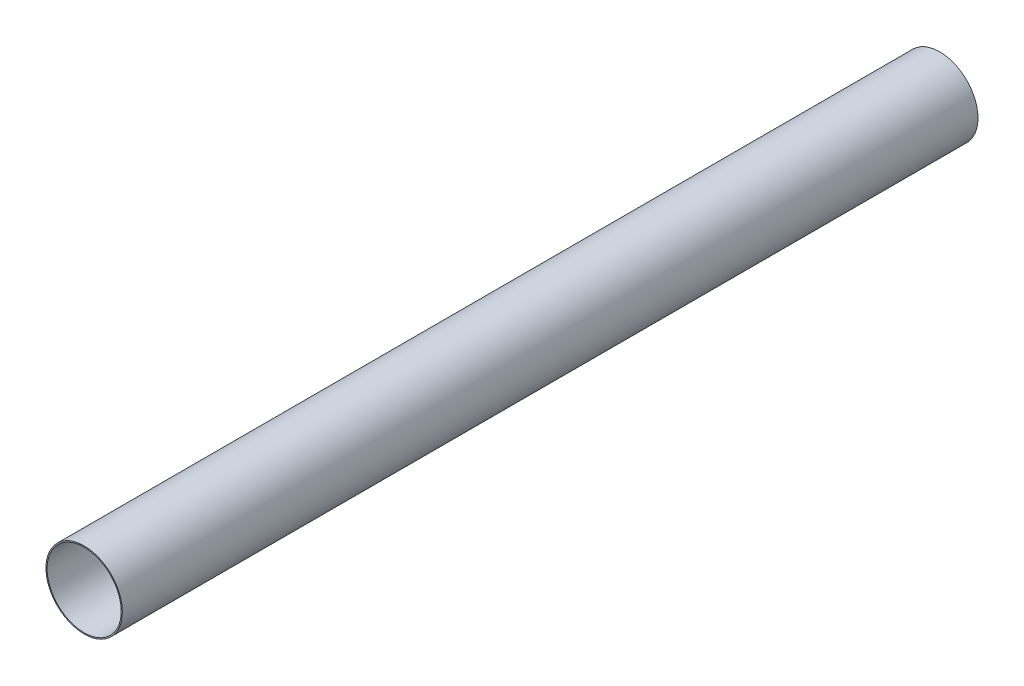
ISO-10303-21;
HEADER;
FILE_DESCRIPTION(('STEP AP214'),'2;1');
FILE_NAME('part.step','',(''),(''),'','','');
FILE_SCHEMA(('AUTOMOTIVE_DESIGN { 1 0 10303 214 1 1 1 1 }'));
ENDSEC;
DATA;
#1=APPLICATION_CONTEXT('core data for automotive mechanical design processes');
#2=APPLICATION_PROTOCOL_DEFINITION('international standard','automotive_design',2000,#1);
#3=PRODUCT_CONTEXT('',#1,'mechanical');
#4=PRODUCT('Part','Part','',(#3));
#5=PRODUCT_RELATED_PRODUCT_CATEGORY('part','',(#4));
#6=PRODUCT_DEFINITION_FORMATION('','',#4);
#7=PRODUCT_DEFINITION_CONTEXT('part definition',#1,'design');
#8=PRODUCT_DEFINITION('design','',#6,#7);
#9=PRODUCT_DEFINITION_SHAPE('','',#8);
#10=(LENGTH_UNIT() NAMED_UNIT(*) SI_UNIT(.MILLI.,.METRE.));
#11=(NAMED_UNIT(*) PLANE_ANGLE_UNIT() SI_UNIT($,.RADIAN.));
#12=(NAMED_UNIT(*) SI_UNIT($,.STERADIAN.) SOLID_ANGLE_UNIT());
#13=UNCERTAINTY_MEASURE_WITH_UNIT(LENGTH_MEASURE(1.E-05),#10,'distance_accuracy_value','');
#14=(GEOMETRIC_REPRESENTATION_CONTEXT(3) GLOBAL_UNCERTAINTY_ASSIGNED_CONTEXT((#13)) GLOBAL_UNIT_ASSIGNED_CONTEXT((#10,
#11,#12)) REPRESENTATION_CONTEXT('',''));
#15=CARTESIAN_POINT('',(0.,0.,0.));
#16=DIRECTION('',(0.,0.,1.));
#17=DIRECTION('',(1.,0.,0.));
#18=AXIS2_PLACEMENT_3D('',#15,#16,#17);
#19=CARTESIAN_POINT('',(0.,0.,1143.));
#20=DIRECTION('',(0.,0.,1.));
#21=DIRECTION('',(1.,0.,0.));
#22=AXIS2_PLACEMENT_3D('',#19,#20,#21);
#23=PLANE('',#22);
#24=CARTESIAN_POINT('',(0.,0.,1143.));
#25=DIRECTION('',(0.,0.,1.));
#26=DIRECTION('',(1.,0.,0.));
#27=AXIS2_PLACEMENT_3D('',#24,#25,#26);
#28=CIRCLE('',#27,51.054);
#29=CARTESIAN_POINT('',(51.054,0.,1143.));
#30=VERTEX_POINT('',#29);
#31=EDGE_CURVE('E10',#30,#30,#28,.T.);
#32=ORIENTED_EDGE('',*,*,#31,.T.);
#33=EDGE_LOOP('',(#32));
#34=FACE_BOUND('',#33,.T.);
#35=CARTESIAN_POINT('',(0.,0.,1143.));
#36=DIRECTION('',(0.,0.,1.));
#37=DIRECTION('',(1.,0.,0.));
#38=AXIS2_PLACEMENT_3D('',#35,#36,#37);
#39=CIRCLE('',#38,49.53);
#40=CARTESIAN_POINT('',(49.53,0.,1143.));
#41=VERTEX_POINT('',#40);
#42=EDGE_CURVE('E45',#41,#41,#39,.T.);
#43=ORIENTED_EDGE('',*,*,#42,.F.);
#44=EDGE_LOOP('',(#43));
#45=FACE_BOUND('',#44,.T.);
#46=ADVANCED_FACE('F34',(#34,#45),#23,.T.);
#47=CARTESIAN_POINT('',(0.,0.,0.));
#48=DIRECTION('',(0.,0.,1.));
#49=DIRECTION('',(1.,0.,0.));
#50=AXIS2_PLACEMENT_3D('',#47,#48,#49);
#51=PLANE('',#50);
#52=CARTESIAN_POINT('',(0.,0.,0.));
#53=DIRECTION('',(0.,0.,1.));
#54=DIRECTION('',(1.,0.,0.));
#55=AXIS2_PLACEMENT_3D('',#52,#53,#54);
#56=CIRCLE('',#55,51.054);
#57=CARTESIAN_POINT('',(51.054,0.,0.));
#58=VERTEX_POINT('',#57);
#59=EDGE_CURVE('E38',#58,#58,#56,.T.);
#60=ORIENTED_EDGE('',*,*,#59,.F.);
#61=EDGE_LOOP('',(#60));
#62=FACE_BOUND('',#61,.T.);
#63=CARTESIAN_POINT('',(0.,0.,0.));
#64=DIRECTION('',(0.,0.,1.));
#65=DIRECTION('',(1.,0.,0.));
#66=AXIS2_PLACEMENT_3D('',#63,#64,#65);
#67=CIRCLE('',#66,49.53);
#68=CARTESIAN_POINT('',(49.53,0.,0.));
#69=VERTEX_POINT('',#68);
#70=EDGE_CURVE('E47',#69,#69,#67,.T.);
#71=ORIENTED_EDGE('',*,*,#70,.T.);
#72=EDGE_LOOP('',(#71));
#73=FACE_BOUND('',#72,.T.);
#74=ADVANCED_FACE('F57',(#62,#73),#51,.F.);
#75=CARTESIAN_POINT('',(0.,0.,1143.));
#76=DIRECTION('',(0.,0.,-1.));
#77=DIRECTION('',(-1.,0.,0.));
#78=AXIS2_PLACEMENT_3D('',#75,#76,#77);
#79=CYLINDRICAL_SURFACE('',#78,51.054);
#80=ORIENTED_EDGE('',*,*,#31,.F.);
#81=EDGE_LOOP('',(#80));
#82=FACE_BOUND('',#81,.T.);
#83=ORIENTED_EDGE('',*,*,#59,.T.);
#84=EDGE_LOOP('',(#83));
#85=FACE_BOUND('',#84,.T.);
#86=ADVANCED_FACE('F36',(#82,#85),#79,.T.);
#87=CARTESIAN_POINT('',(0.,0.,1143.));
#88=DIRECTION('',(0.,0.,-1.));
#89=DIRECTION('',(-1.,0.,0.));
#90=AXIS2_PLACEMENT_3D('',#87,#88,#89);
#91=CYLINDRICAL_SURFACE('',#90,49.53);
#92=ORIENTED_EDGE('',*,*,#42,.T.);
#93=EDGE_LOOP('',(#92));
#94=FACE_BOUND('',#93,.T.);
#95=ORIENTED_EDGE('',*,*,#70,.F.);
#96=EDGE_LOOP('',(#95));
#97=FACE_BOUND('',#96,.T.);
#98=ADVANCED_FACE('F53',(#94,#97),#91,.F.);
#99=CLOSED_SHELL('',(#46,#74,#86,#98));
#100=MANIFOLD_SOLID_BREP('B2',#99);
#101=ADVANCED_BREP_SHAPE_REPRESENTATION('',(#18,#100),#14);
#102=SHAPE_DEFINITION_REPRESENTATION(#9,#101);
ENDSEC;
END-ISO-10303-21;
